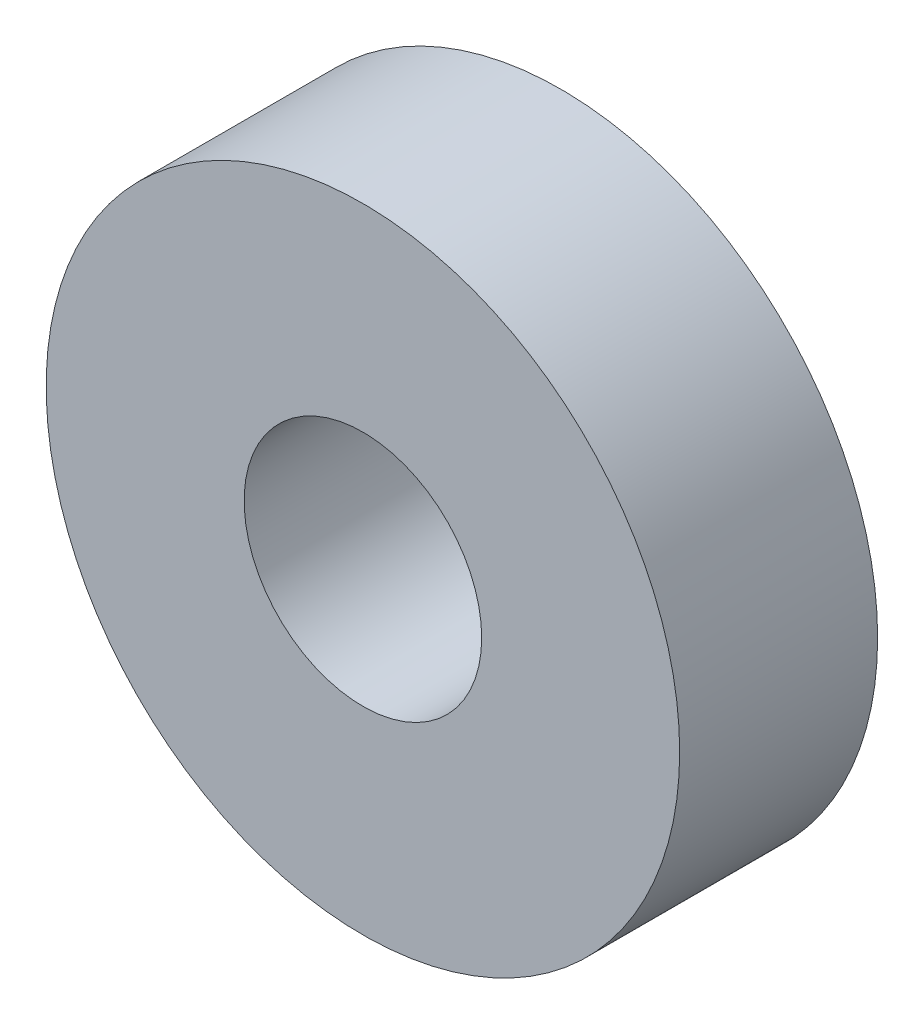
ISO-10303-21;
HEADER;
FILE_DESCRIPTION(('STEP AP214'),'2;1');
FILE_NAME('part.step','',(''),(''),'','','');
FILE_SCHEMA(('AUTOMOTIVE_DESIGN { 1 0 10303 214 1 1 1 1 }'));
ENDSEC;
DATA;
#1=APPLICATION_CONTEXT('core data for automotive mechanical design processes');
#2=APPLICATION_PROTOCOL_DEFINITION('international standard','automotive_design',2000,#1);
#3=PRODUCT_CONTEXT('',#1,'mechanical');
#4=PRODUCT('Part','Part','',(#3));
#5=PRODUCT_RELATED_PRODUCT_CATEGORY('part','',(#4));
#6=PRODUCT_DEFINITION_FORMATION('','',#4);
#7=PRODUCT_DEFINITION_CONTEXT('part definition',#1,'design');
#8=PRODUCT_DEFINITION('design','',#6,#7);
#9=PRODUCT_DEFINITION_SHAPE('','',#8);
#10=(LENGTH_UNIT() NAMED_UNIT(*) SI_UNIT(.MILLI.,.METRE.));
#11=(NAMED_UNIT(*) PLANE_ANGLE_UNIT() SI_UNIT($,.RADIAN.));
#12=(NAMED_UNIT(*) SI_UNIT($,.STERADIAN.) SOLID_ANGLE_UNIT());
#13=UNCERTAINTY_MEASURE_WITH_UNIT(LENGTH_MEASURE(1.E-05),#10,'distance_accuracy_value','');
#14=(GEOMETRIC_REPRESENTATION_CONTEXT(3) GLOBAL_UNCERTAINTY_ASSIGNED_CONTEXT((#13)) GLOBAL_UNIT_ASSIGNED_CONTEXT((#10,
#11,#12)) REPRESENTATION_CONTEXT('',''));
#15=CARTESIAN_POINT('',(0.,0.,0.));
#16=DIRECTION('',(0.,0.,1.));
#17=DIRECTION('',(1.,0.,0.));
#18=AXIS2_PLACEMENT_3D('',#15,#16,#17);
#19=CARTESIAN_POINT('',(0.,0.,5.));
#20=DIRECTION('',(0.,0.,1.));
#21=DIRECTION('',(1.,0.,0.));
#22=AXIS2_PLACEMENT_3D('',#19,#20,#21);
#23=PLANE('',#22);
#24=CARTESIAN_POINT('',(0.,0.,5.));
#25=DIRECTION('',(0.,0.,1.));
#26=DIRECTION('',(1.,0.,0.));
#27=AXIS2_PLACEMENT_3D('',#24,#25,#26);
#28=CIRCLE('',#27,8.);
#29=CARTESIAN_POINT('',(8.,0.,5.));
#30=VERTEX_POINT('',#29);
#31=EDGE_CURVE('E10',#30,#30,#28,.T.);
#32=ORIENTED_EDGE('',*,*,#31,.T.);
#33=EDGE_LOOP('',(#32));
#34=FACE_BOUND('',#33,.T.);
#35=CARTESIAN_POINT('',(0.,0.,5.));
#36=DIRECTION('',(0.,0.,1.));
#37=DIRECTION('',(1.,0.,0.));
#38=AXIS2_PLACEMENT_3D('',#35,#36,#37);
#39=CIRCLE('',#38,3.);
#40=CARTESIAN_POINT('',(3.,0.,5.));
#41=VERTEX_POINT('',#40);
#42=EDGE_CURVE('E42',#41,#41,#39,.T.);
#43=ORIENTED_EDGE('',*,*,#42,.F.);
#44=EDGE_LOOP('',(#43));
#45=FACE_BOUND('',#44,.T.);
#46=ADVANCED_FACE('F31',(#34,#45),#23,.T.);
#47=CARTESIAN_POINT('',(0.,0.,0.));
#48=DIRECTION('',(0.,0.,1.));
#49=DIRECTION('',(1.,0.,0.));
#50=AXIS2_PLACEMENT_3D('',#47,#48,#49);
#51=PLANE('',#50);
#52=CARTESIAN_POINT('',(0.,0.,0.));
#53=DIRECTION('',(0.,0.,1.));
#54=DIRECTION('',(1.,0.,0.));
#55=AXIS2_PLACEMENT_3D('',#52,#53,#54);
#56=CIRCLE('',#55,8.);
#57=CARTESIAN_POINT('',(8.,0.,0.));
#58=VERTEX_POINT('',#57);
#59=EDGE_CURVE('E35',#58,#58,#56,.T.);
#60=ORIENTED_EDGE('',*,*,#59,.F.);
#61=EDGE_LOOP('',(#60));
#62=FACE_BOUND('',#61,.T.);
#63=CARTESIAN_POINT('',(0.,0.,0.));
#64=DIRECTION('',(0.,0.,1.));
#65=DIRECTION('',(1.,0.,0.));
#66=AXIS2_PLACEMENT_3D('',#63,#64,#65);
#67=CIRCLE('',#66,3.);
#68=CARTESIAN_POINT('',(3.,0.,0.));
#69=VERTEX_POINT('',#68);
#70=EDGE_CURVE('E44',#69,#69,#67,.T.);
#71=ORIENTED_EDGE('',*,*,#70,.T.);
#72=EDGE_LOOP('',(#71));
#73=FACE_BOUND('',#72,.T.);
#74=ADVANCED_FACE('F54',(#62,#73),#51,.F.);
#75=CARTESIAN_POINT('',(0.,0.,5.));
#76=DIRECTION('',(0.,0.,-1.));
#77=DIRECTION('',(-1.,0.,0.));
#78=AXIS2_PLACEMENT_3D('',#75,#76,#77);
#79=CYLINDRICAL_SURFACE('',#78,8.);
#80=ORIENTED_EDGE('',*,*,#31,.F.);
#81=EDGE_LOOP('',(#80));
#82=FACE_BOUND('',#81,.T.);
#83=ORIENTED_EDGE('',*,*,#59,.T.);
#84=EDGE_LOOP('',(#83));
#85=FACE_BOUND('',#84,.T.);
#86=ADVANCED_FACE('F33',(#82,#85),#79,.T.);
#87=CARTESIAN_POINT('',(0.,0.,5.));
#88=DIRECTION('',(0.,0.,-1.));
#89=DIRECTION('',(-1.,0.,0.));
#90=AXIS2_PLACEMENT_3D('',#87,#88,#89);
#91=CYLINDRICAL_SURFACE('',#90,3.);
#92=ORIENTED_EDGE('',*,*,#42,.T.);
#93=EDGE_LOOP('',(#92));
#94=FACE_BOUND('',#93,.T.);
#95=ORIENTED_EDGE('',*,*,#70,.F.);
#96=EDGE_LOOP('',(#95));
#97=FACE_BOUND('',#96,.T.);
#98=ADVANCED_FACE('F50',(#94,#97),#91,.F.);
#99=CLOSED_SHELL('',(#46,#74,#86,#98));
#100=MANIFOLD_SOLID_BREP('B2',#99);
#101=ADVANCED_BREP_SHAPE_REPRESENTATION('',(#18,#100),#14);
#102=SHAPE_DEFINITION_REPRESENTATION(#9,#101);
ENDSEC;
END-ISO-10303-21;
